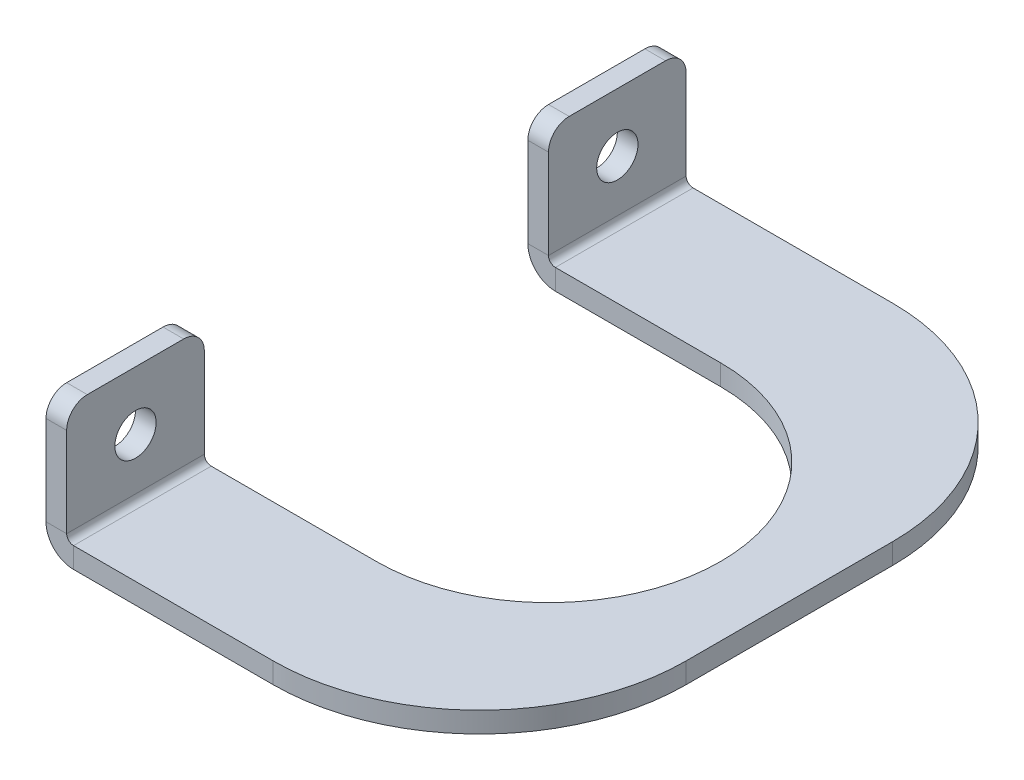
ISO-10303-21;
HEADER;
FILE_DESCRIPTION(('STEP AP214'),'2;1');
FILE_NAME('part.step','',(''),(''),'','','');
FILE_SCHEMA(('AUTOMOTIVE_DESIGN { 1 0 10303 214 1 1 1 1 }'));
ENDSEC;
DATA;
#1=APPLICATION_CONTEXT('core data for automotive mechanical design processes');
#2=APPLICATION_PROTOCOL_DEFINITION('international standard','automotive_design',2000,#1);
#3=PRODUCT_CONTEXT('',#1,'mechanical');
#4=PRODUCT('Part','Part','',(#3));
#5=PRODUCT_RELATED_PRODUCT_CATEGORY('part','',(#4));
#6=PRODUCT_DEFINITION_FORMATION('','',#4);
#7=PRODUCT_DEFINITION_CONTEXT('part definition',#1,'design');
#8=PRODUCT_DEFINITION('design','',#6,#7);
#9=PRODUCT_DEFINITION_SHAPE('','',#8);
#10=(LENGTH_UNIT() NAMED_UNIT(*) SI_UNIT(.MILLI.,.METRE.));
#11=(NAMED_UNIT(*) PLANE_ANGLE_UNIT() SI_UNIT($,.RADIAN.));
#12=(NAMED_UNIT(*) SI_UNIT($,.STERADIAN.) SOLID_ANGLE_UNIT());
#13=UNCERTAINTY_MEASURE_WITH_UNIT(LENGTH_MEASURE(1.E-05),#10,'distance_accuracy_value','');
#14=(GEOMETRIC_REPRESENTATION_CONTEXT(3) GLOBAL_UNCERTAINTY_ASSIGNED_CONTEXT((#13)) GLOBAL_UNIT_ASSIGNED_CONTEXT((#10,
#11,#12)) REPRESENTATION_CONTEXT('',''));
#15=CARTESIAN_POINT('',(0.,0.,0.));
#16=DIRECTION('',(0.,0.,1.));
#17=DIRECTION('',(1.,0.,0.));
#18=AXIS2_PLACEMENT_3D('',#15,#16,#17);
#19=CARTESIAN_POINT('',(0.,3.,0.));
#20=DIRECTION('',(0.,-1.,0.));
#21=DIRECTION('',(0.,0.,-1.));
#22=AXIS2_PLACEMENT_3D('',#19,#20,#21);
#23=PLANE('',#22);
#24=DIRECTION('',(0.,0.,1.));
#25=VECTOR('',#24,1.);
#26=CARTESIAN_POINT('',(-24.,3.,-25.));
#27=LINE('',#26,#25);
#28=CARTESIAN_POINT('',(-24.,3.,-25.));
#29=VERTEX_POINT('',#28);
#30=CARTESIAN_POINT('',(-24.,3.,-45.));
#31=VERTEX_POINT('',#30);
#32=EDGE_CURVE('E243',#29,#31,#27,.F.);
#33=ORIENTED_EDGE('',*,*,#32,.F.);
#34=DIRECTION('',(1.,0.,0.));
#35=VECTOR('',#34,1.);
#36=CARTESIAN_POINT('',(0.,3.,-25.));
#37=LINE('',#36,#35);
#38=CARTESIAN_POINT('',(0.,3.,-25.));
#39=VERTEX_POINT('',#38);
#40=EDGE_CURVE('E318',#29,#39,#37,.T.);
#41=ORIENTED_EDGE('',*,*,#40,.T.);
#42=CARTESIAN_POINT('',(0.,3.,0.));
#43=DIRECTION('',(0.,-1.,0.));
#44=DIRECTION('',(0.,0.,-1.));
#45=AXIS2_PLACEMENT_3D('',#42,#43,#44);
#46=CIRCLE('',#45,25.);
#47=CARTESIAN_POINT('',(0.,3.,25.));
#48=VERTEX_POINT('',#47);
#49=EDGE_CURVE('E297',#39,#48,#46,.T.);
#50=ORIENTED_EDGE('',*,*,#49,.T.);
#51=DIRECTION('',(-1.,0.,0.));
#52=VECTOR('',#51,1.);
#53=CARTESIAN_POINT('',(-25.,3.,25.));
#54=LINE('',#53,#52);
#55=CARTESIAN_POINT('',(-24.,3.,25.));
#56=VERTEX_POINT('',#55);
#57=EDGE_CURVE('E300',#48,#56,#54,.T.);
#58=ORIENTED_EDGE('',*,*,#57,.T.);
#59=DIRECTION('',(0.,0.,1.));
#60=VECTOR('',#59,1.);
#61=CARTESIAN_POINT('',(-24.,3.,45.));
#62=LINE('',#61,#60);
#63=CARTESIAN_POINT('',(-24.,3.,45.));
#64=VERTEX_POINT('',#63);
#65=EDGE_CURVE('E287',#64,#56,#62,.F.);
#66=ORIENTED_EDGE('',*,*,#65,.F.);
#67=DIRECTION('',(1.,0.,0.));
#68=VECTOR('',#67,1.);
#69=CARTESIAN_POINT('',(5.,3.,45.));
#70=LINE('',#69,#68);
#71=CARTESIAN_POINT('',(5.,3.,45.));
#72=VERTEX_POINT('',#71);
#73=EDGE_CURVE('E304',#64,#72,#70,.T.);
#74=ORIENTED_EDGE('',*,*,#73,.T.);
#75=CARTESIAN_POINT('',(5.,3.,15.));
#76=DIRECTION('',(0.,1.,0.));
#77=DIRECTION('',(0.,0.,-1.));
#78=AXIS2_PLACEMENT_3D('',#75,#76,#77);
#79=CIRCLE('',#78,30.);
#80=CARTESIAN_POINT('',(35.,3.,15.));
#81=VERTEX_POINT('',#80);
#82=EDGE_CURVE('E306',#72,#81,#79,.T.);
#83=ORIENTED_EDGE('',*,*,#82,.T.);
#84=DIRECTION('',(0.,0.,-1.));
#85=VECTOR('',#84,1.);
#86=CARTESIAN_POINT('',(35.,3.,-15.));
#87=LINE('',#86,#85);
#88=CARTESIAN_POINT('',(35.,3.,-15.));
#89=VERTEX_POINT('',#88);
#90=EDGE_CURVE('E309',#81,#89,#87,.T.);
#91=ORIENTED_EDGE('',*,*,#90,.T.);
#92=CARTESIAN_POINT('',(5.,3.,-15.));
#93=DIRECTION('',(0.,1.,0.));
#94=DIRECTION('',(0.,0.,-1.));
#95=AXIS2_PLACEMENT_3D('',#92,#93,#94);
#96=CIRCLE('',#95,30.);
#97=CARTESIAN_POINT('',(5.,3.,-45.));
#98=VERTEX_POINT('',#97);
#99=EDGE_CURVE('E312',#89,#98,#96,.T.);
#100=ORIENTED_EDGE('',*,*,#99,.T.);
#101=DIRECTION('',(-1.,0.,0.));
#102=VECTOR('',#101,1.);
#103=CARTESIAN_POINT('',(-25.,3.,-45.));
#104=LINE('',#103,#102);
#105=EDGE_CURVE('E315',#98,#31,#104,.T.);
#106=ORIENTED_EDGE('',*,*,#105,.T.);
#107=EDGE_LOOP('',(#33,#41,#50,#58,#66,#74,#83,#91,#100,#106));
#108=FACE_BOUND('',#107,.T.);
#109=ADVANCED_FACE('F38',(#108),#23,.F.);
#110=CARTESIAN_POINT('',(0.,0.,0.));
#111=DIRECTION('',(0.,-1.,0.));
#112=DIRECTION('',(0.,0.,-1.));
#113=AXIS2_PLACEMENT_3D('',#110,#111,#112);
#114=PLANE('',#113);
#115=DIRECTION('',(1.,0.,0.));
#116=VECTOR('',#115,1.);
#117=CARTESIAN_POINT('',(0.,0.,-25.));
#118=LINE('',#117,#116);
#119=CARTESIAN_POINT('',(-24.,0.,-25.));
#120=VERTEX_POINT('',#119);
#121=CARTESIAN_POINT('',(0.,0.,-25.));
#122=VERTEX_POINT('',#121);
#123=EDGE_CURVE('E301',#120,#122,#118,.T.);
#124=ORIENTED_EDGE('',*,*,#123,.F.);
#125=DIRECTION('',(0.,0.,1.));
#126=VECTOR('',#125,1.);
#127=CARTESIAN_POINT('',(-24.,0.,-25.));
#128=LINE('',#127,#126);
#129=CARTESIAN_POINT('',(-24.,0.,-45.));
#130=VERTEX_POINT('',#129);
#131=EDGE_CURVE('E196',#120,#130,#128,.F.);
#132=ORIENTED_EDGE('',*,*,#131,.T.);
#133=DIRECTION('',(1.,0.,0.));
#134=VECTOR('',#133,1.);
#135=CARTESIAN_POINT('',(0.,0.,-45.));
#136=LINE('',#135,#134);
#137=CARTESIAN_POINT('',(5.,0.,-45.));
#138=VERTEX_POINT('',#137);
#139=EDGE_CURVE('E325',#138,#130,#136,.F.);
#140=ORIENTED_EDGE('',*,*,#139,.F.);
#141=CARTESIAN_POINT('',(5.,0.,-15.));
#142=DIRECTION('',(0.,1.,0.));
#143=DIRECTION('',(0.,0.,1.));
#144=AXIS2_PLACEMENT_3D('',#141,#142,#143);
#145=CIRCLE('',#144,30.);
#146=CARTESIAN_POINT('',(35.,0.,-15.));
#147=VERTEX_POINT('',#146);
#148=EDGE_CURVE('E328',#147,#138,#145,.T.);
#149=ORIENTED_EDGE('',*,*,#148,.F.);
#150=DIRECTION('',(0.,0.,-1.));
#151=VECTOR('',#150,1.);
#152=CARTESIAN_POINT('',(35.,0.,0.));
#153=LINE('',#152,#151);
#154=CARTESIAN_POINT('',(35.,0.,15.));
#155=VERTEX_POINT('',#154);
#156=EDGE_CURVE('E331',#155,#147,#153,.T.);
#157=ORIENTED_EDGE('',*,*,#156,.F.);
#158=CARTESIAN_POINT('',(5.,0.,15.));
#159=DIRECTION('',(0.,1.,0.));
#160=DIRECTION('',(0.,0.,1.));
#161=AXIS2_PLACEMENT_3D('',#158,#159,#160);
#162=CIRCLE('',#161,30.);
#163=CARTESIAN_POINT('',(5.,0.,45.));
#164=VERTEX_POINT('',#163);
#165=EDGE_CURVE('E334',#164,#155,#162,.T.);
#166=ORIENTED_EDGE('',*,*,#165,.F.);
#167=DIRECTION('',(1.,0.,0.));
#168=VECTOR('',#167,1.);
#169=CARTESIAN_POINT('',(0.,0.,45.));
#170=LINE('',#169,#168);
#171=CARTESIAN_POINT('',(-24.,0.,45.));
#172=VERTEX_POINT('',#171);
#173=EDGE_CURVE('E337',#172,#164,#170,.T.);
#174=ORIENTED_EDGE('',*,*,#173,.F.);
#175=DIRECTION('',(0.,0.,1.));
#176=VECTOR('',#175,1.);
#177=CARTESIAN_POINT('',(-24.,0.,45.));
#178=LINE('',#177,#176);
#179=CARTESIAN_POINT('',(-24.,0.,25.));
#180=VERTEX_POINT('',#179);
#181=EDGE_CURVE('E274',#172,#180,#178,.F.);
#182=ORIENTED_EDGE('',*,*,#181,.T.);
#183=DIRECTION('',(1.,0.,0.));
#184=VECTOR('',#183,1.);
#185=CARTESIAN_POINT('',(0.,0.,25.));
#186=LINE('',#185,#184);
#187=CARTESIAN_POINT('',(0.,0.,25.));
#188=VERTEX_POINT('',#187);
#189=EDGE_CURVE('E323',#188,#180,#186,.F.);
#190=ORIENTED_EDGE('',*,*,#189,.F.);
#191=CARTESIAN_POINT('',(0.,0.,0.));
#192=DIRECTION('',(0.,-1.,0.));
#193=DIRECTION('',(0.,0.,-1.));
#194=AXIS2_PLACEMENT_3D('',#191,#192,#193);
#195=CIRCLE('',#194,25.);
#196=EDGE_CURVE('E294',#122,#188,#195,.T.);
#197=ORIENTED_EDGE('',*,*,#196,.F.);
#198=EDGE_LOOP('',(#124,#132,#140,#149,#157,#166,#174,#182,#190,#197));
#199=FACE_BOUND('',#198,.T.);
#200=ADVANCED_FACE('F421',(#199),#114,.T.);
#201=CARTESIAN_POINT('',(0.,3.,-25.));
#202=DIRECTION('',(0.,0.,-1.));
#203=DIRECTION('',(1.,0.,0.));
#204=AXIS2_PLACEMENT_3D('',#201,#202,#203);
#205=PLANE('',#204);
#206=ORIENTED_EDGE('',*,*,#40,.F.);
#207=DIRECTION('',(0.,-1.,0.));
#208=VECTOR('',#207,1.);
#209=CARTESIAN_POINT('',(-24.,3.,-25.));
#210=LINE('',#209,#208);
#211=EDGE_CURVE('E239',#29,#120,#210,.T.);
#212=ORIENTED_EDGE('',*,*,#211,.T.);
#213=ORIENTED_EDGE('',*,*,#123,.T.);
#214=DIRECTION('',(0.,1.,0.));
#215=VECTOR('',#214,1.);
#216=CARTESIAN_POINT('',(0.,3.,-25.));
#217=LINE('',#216,#215);
#218=EDGE_CURVE('E341',#122,#39,#217,.T.);
#219=ORIENTED_EDGE('',*,*,#218,.T.);
#220=EDGE_LOOP('',(#206,#212,#213,#219));
#221=FACE_BOUND('',#220,.T.);
#222=ADVANCED_FACE('F434',(#221),#205,.F.);
#223=CARTESIAN_POINT('',(5.,3.,45.));
#224=DIRECTION('',(0.,0.,-1.));
#225=DIRECTION('',(1.,0.,0.));
#226=AXIS2_PLACEMENT_3D('',#223,#224,#225);
#227=PLANE('',#226);
#228=ORIENTED_EDGE('',*,*,#73,.F.);
#229=DIRECTION('',(0.,-1.,0.));
#230=VECTOR('',#229,1.);
#231=CARTESIAN_POINT('',(-24.,3.,45.));
#232=LINE('',#231,#230);
#233=EDGE_CURVE('E281',#64,#172,#232,.T.);
#234=ORIENTED_EDGE('',*,*,#233,.T.);
#235=ORIENTED_EDGE('',*,*,#173,.T.);
#236=DIRECTION('',(0.,1.,0.));
#237=VECTOR('',#236,1.);
#238=CARTESIAN_POINT('',(5.,3.,45.));
#239=LINE('',#238,#237);
#240=EDGE_CURVE('E350',#164,#72,#239,.T.);
#241=ORIENTED_EDGE('',*,*,#240,.T.);
#242=EDGE_LOOP('',(#228,#234,#235,#241));
#243=FACE_BOUND('',#242,.T.);
#244=ADVANCED_FACE('F454',(#243),#227,.F.);
#245=CARTESIAN_POINT('',(5.,3.,15.));
#246=DIRECTION('',(0.,-1.,0.));
#247=DIRECTION('',(0.,0.,-1.));
#248=AXIS2_PLACEMENT_3D('',#245,#246,#247);
#249=CYLINDRICAL_SURFACE('',#248,30.);
#250=ORIENTED_EDGE('',*,*,#240,.F.);
#251=ORIENTED_EDGE('',*,*,#165,.T.);
#252=DIRECTION('',(0.,1.,0.));
#253=VECTOR('',#252,1.);
#254=CARTESIAN_POINT('',(35.,3.,15.));
#255=LINE('',#254,#253);
#256=EDGE_CURVE('E348',#155,#81,#255,.T.);
#257=ORIENTED_EDGE('',*,*,#256,.T.);
#258=ORIENTED_EDGE('',*,*,#82,.F.);
#259=EDGE_LOOP('',(#250,#251,#257,#258));
#260=FACE_BOUND('',#259,.T.);
#261=ADVANCED_FACE('F451',(#260),#249,.T.);
#262=CARTESIAN_POINT('',(35.,3.,-15.));
#263=DIRECTION('',(-1.,0.,0.));
#264=DIRECTION('',(0.,0.,-1.));
#265=AXIS2_PLACEMENT_3D('',#262,#263,#264);
#266=PLANE('',#265);
#267=ORIENTED_EDGE('',*,*,#256,.F.);
#268=ORIENTED_EDGE('',*,*,#156,.T.);
#269=DIRECTION('',(0.,1.,0.));
#270=VECTOR('',#269,1.);
#271=CARTESIAN_POINT('',(35.,3.,-15.));
#272=LINE('',#271,#270);
#273=EDGE_CURVE('E346',#147,#89,#272,.T.);
#274=ORIENTED_EDGE('',*,*,#273,.T.);
#275=ORIENTED_EDGE('',*,*,#90,.F.);
#276=EDGE_LOOP('',(#267,#268,#274,#275));
#277=FACE_BOUND('',#276,.T.);
#278=ADVANCED_FACE('F447',(#277),#266,.F.);
#279=CARTESIAN_POINT('',(5.,3.,-15.));
#280=DIRECTION('',(0.,-1.,0.));
#281=DIRECTION('',(0.,0.,-1.));
#282=AXIS2_PLACEMENT_3D('',#279,#280,#281);
#283=CYLINDRICAL_SURFACE('',#282,30.);
#284=ORIENTED_EDGE('',*,*,#273,.F.);
#285=ORIENTED_EDGE('',*,*,#148,.T.);
#286=DIRECTION('',(0.,1.,0.));
#287=VECTOR('',#286,1.);
#288=CARTESIAN_POINT('',(5.,3.,-45.));
#289=LINE('',#288,#287);
#290=EDGE_CURVE('E344',#138,#98,#289,.T.);
#291=ORIENTED_EDGE('',*,*,#290,.T.);
#292=ORIENTED_EDGE('',*,*,#99,.F.);
#293=EDGE_LOOP('',(#284,#285,#291,#292));
#294=FACE_BOUND('',#293,.T.);
#295=ADVANCED_FACE('F443',(#294),#283,.T.);
#296=CARTESIAN_POINT('',(-25.,3.,-45.));
#297=DIRECTION('',(0.,0.,1.));
#298=DIRECTION('',(-1.,0.,0.));
#299=AXIS2_PLACEMENT_3D('',#296,#297,#298);
#300=PLANE('',#299);
#301=DIRECTION('',(0.,-1.,0.));
#302=VECTOR('',#301,1.);
#303=CARTESIAN_POINT('',(-24.,3.,-45.));
#304=LINE('',#303,#302);
#305=EDGE_CURVE('E246',#31,#130,#304,.T.);
#306=ORIENTED_EDGE('',*,*,#305,.F.);
#307=ORIENTED_EDGE('',*,*,#105,.F.);
#308=ORIENTED_EDGE('',*,*,#290,.F.);
#309=ORIENTED_EDGE('',*,*,#139,.T.);
#310=EDGE_LOOP('',(#306,#307,#308,#309));
#311=FACE_BOUND('',#310,.T.);
#312=ADVANCED_FACE('F439',(#311),#300,.F.);
#313=CARTESIAN_POINT('',(0.,3.,0.));
#314=DIRECTION('',(0.,-1.,0.));
#315=DIRECTION('',(0.,0.,-1.));
#316=AXIS2_PLACEMENT_3D('',#313,#314,#315);
#317=CYLINDRICAL_SURFACE('',#316,25.);
#318=ORIENTED_EDGE('',*,*,#218,.F.);
#319=ORIENTED_EDGE('',*,*,#196,.T.);
#320=DIRECTION('',(0.,1.,0.));
#321=VECTOR('',#320,1.);
#322=CARTESIAN_POINT('',(0.,3.,25.));
#323=LINE('',#322,#321);
#324=EDGE_CURVE('E320',#188,#48,#323,.T.);
#325=ORIENTED_EDGE('',*,*,#324,.T.);
#326=ORIENTED_EDGE('',*,*,#49,.F.);
#327=EDGE_LOOP('',(#318,#319,#325,#326));
#328=FACE_BOUND('',#327,.T.);
#329=ADVANCED_FACE('F428',(#328),#317,.F.);
#330=CARTESIAN_POINT('',(-25.,3.,25.));
#331=DIRECTION('',(0.,0.,1.));
#332=DIRECTION('',(-1.,0.,0.));
#333=AXIS2_PLACEMENT_3D('',#330,#331,#332);
#334=PLANE('',#333);
#335=DIRECTION('',(0.,-1.,0.));
#336=VECTOR('',#335,1.);
#337=CARTESIAN_POINT('',(-24.,3.,25.));
#338=LINE('',#337,#336);
#339=EDGE_CURVE('E291',#56,#180,#338,.T.);
#340=ORIENTED_EDGE('',*,*,#339,.F.);
#341=ORIENTED_EDGE('',*,*,#57,.F.);
#342=ORIENTED_EDGE('',*,*,#324,.F.);
#343=ORIENTED_EDGE('',*,*,#189,.T.);
#344=EDGE_LOOP('',(#340,#341,#342,#343));
#345=FACE_BOUND('',#344,.T.);
#346=ADVANCED_FACE('F424',(#345),#334,.F.);
#347=CARTESIAN_POINT('',(-24.,4.,25.));
#348=DIRECTION('',(0.,0.,-1.));
#349=DIRECTION('',(-1.,0.,0.));
#350=AXIS2_PLACEMENT_3D('',#347,#348,#349);
#351=PLANE('',#350);
#352=DIRECTION('',(-1.,0.,0.));
#353=VECTOR('',#352,1.);
#354=CARTESIAN_POINT('',(-25.,4.,25.));
#355=LINE('',#354,#353);
#356=CARTESIAN_POINT('',(-25.,4.,25.));
#357=VERTEX_POINT('',#356);
#358=CARTESIAN_POINT('',(-28.,3.99999999999999,25.));
#359=VERTEX_POINT('',#358);
#360=EDGE_CURVE('E249',#357,#359,#355,.T.);
#361=ORIENTED_EDGE('',*,*,#360,.F.);
#362=CARTESIAN_POINT('',(-24.,4.,25.));
#363=DIRECTION('',(0.,0.,1.));
#364=DIRECTION('',(1.,0.,0.));
#365=AXIS2_PLACEMENT_3D('',#362,#363,#364);
#366=CIRCLE('',#365,1.);
#367=EDGE_CURVE('E284',#56,#357,#366,.F.);
#368=ORIENTED_EDGE('',*,*,#367,.F.);
#369=ORIENTED_EDGE('',*,*,#339,.T.);
#370=CARTESIAN_POINT('',(-24.,4.,25.));
#371=DIRECTION('',(0.,0.,1.));
#372=DIRECTION('',(1.,0.,0.));
#373=AXIS2_PLACEMENT_3D('',#370,#371,#372);
#374=CIRCLE('',#373,4.);
#375=EDGE_CURVE('E277',#180,#359,#374,.F.);
#376=ORIENTED_EDGE('',*,*,#375,.T.);
#377=EDGE_LOOP('',(#361,#368,#369,#376));
#378=FACE_BOUND('',#377,.T.);
#379=ADVANCED_FACE('F412',(#378),#351,.T.);
#380=CARTESIAN_POINT('',(-24.,4.,45.));
#381=DIRECTION('',(0.,0.,-1.));
#382=DIRECTION('',(-1.,0.,0.));
#383=AXIS2_PLACEMENT_3D('',#380,#381,#382);
#384=PLANE('',#383);
#385=CARTESIAN_POINT('',(-24.,4.,45.));
#386=DIRECTION('',(0.,0.,1.));
#387=DIRECTION('',(1.,0.,0.));
#388=AXIS2_PLACEMENT_3D('',#385,#386,#387);
#389=CIRCLE('',#388,1.);
#390=CARTESIAN_POINT('',(-25.,4.,45.));
#391=VERTEX_POINT('',#390);
#392=EDGE_CURVE('E269',#391,#64,#389,.T.);
#393=ORIENTED_EDGE('',*,*,#392,.F.);
#394=DIRECTION('',(-1.,0.,0.));
#395=VECTOR('',#394,1.);
#396=CARTESIAN_POINT('',(-25.,4.,45.));
#397=LINE('',#396,#395);
#398=CARTESIAN_POINT('',(-28.,3.99999999999999,45.));
#399=VERTEX_POINT('',#398);
#400=EDGE_CURVE('E253',#391,#399,#397,.T.);
#401=ORIENTED_EDGE('',*,*,#400,.T.);
#402=CARTESIAN_POINT('',(-24.,4.,45.));
#403=DIRECTION('',(0.,0.,1.));
#404=DIRECTION('',(1.,0.,0.));
#405=AXIS2_PLACEMENT_3D('',#402,#403,#404);
#406=CIRCLE('',#405,4.);
#407=EDGE_CURVE('E278',#399,#172,#406,.T.);
#408=ORIENTED_EDGE('',*,*,#407,.T.);
#409=ORIENTED_EDGE('',*,*,#233,.F.);
#410=EDGE_LOOP('',(#393,#401,#408,#409));
#411=FACE_BOUND('',#410,.T.);
#412=ADVANCED_FACE('F408',(#411),#384,.F.);
#413=CARTESIAN_POINT('',(-24.,4.,45.));
#414=DIRECTION('',(0.,0.,1.));
#415=DIRECTION('',(-1.,0.,0.));
#416=AXIS2_PLACEMENT_3D('',#413,#414,#415);
#417=CYLINDRICAL_SURFACE('',#416,4.);
#418=ORIENTED_EDGE('',*,*,#181,.F.);
#419=ORIENTED_EDGE('',*,*,#407,.F.);
#420=DIRECTION('',(0.,0.,-1.));
#421=VECTOR('',#420,1.);
#422=CARTESIAN_POINT('',(-28.,3.99999999999999,0.));
#423=LINE('',#422,#421);
#424=EDGE_CURVE('E256',#399,#359,#423,.T.);
#425=ORIENTED_EDGE('',*,*,#424,.T.);
#426=ORIENTED_EDGE('',*,*,#375,.F.);
#427=EDGE_LOOP('',(#418,#419,#425,#426));
#428=FACE_BOUND('',#427,.T.);
#429=ADVANCED_FACE('F410',(#428),#417,.T.);
#430=CARTESIAN_POINT('',(-24.,4.,45.));
#431=DIRECTION('',(0.,0.,1.));
#432=DIRECTION('',(-1.,0.,0.));
#433=AXIS2_PLACEMENT_3D('',#430,#431,#432);
#434=CYLINDRICAL_SURFACE('',#433,1.);
#435=ORIENTED_EDGE('',*,*,#65,.T.);
#436=ORIENTED_EDGE('',*,*,#367,.T.);
#437=DIRECTION('',(0.,0.,1.));
#438=VECTOR('',#437,1.);
#439=CARTESIAN_POINT('',(-25.,4.,25.));
#440=LINE('',#439,#438);
#441=EDGE_CURVE('E251',#357,#391,#440,.T.);
#442=ORIENTED_EDGE('',*,*,#441,.T.);
#443=ORIENTED_EDGE('',*,*,#392,.T.);
#444=EDGE_LOOP('',(#435,#436,#442,#443));
#445=FACE_BOUND('',#444,.T.);
#446=ADVANCED_FACE('F456',(#445),#434,.F.);
#447=CARTESIAN_POINT('',(-28.,2.99999999999999,25.));
#448=DIRECTION('',(0.,0.,1.));
#449=DIRECTION('',(1.,0.,0.));
#450=AXIS2_PLACEMENT_3D('',#447,#448,#449);
#451=PLANE('',#450);
#452=DIRECTION('',(0.,-1.,0.));
#453=VECTOR('',#452,1.);
#454=CARTESIAN_POINT('',(-28.,2.99999999999999,25.));
#455=LINE('',#454,#453);
#456=CARTESIAN_POINT('',(-28.,17.,25.));
#457=VERTEX_POINT('',#456);
#458=EDGE_CURVE('E262',#457,#359,#455,.T.);
#459=ORIENTED_EDGE('',*,*,#458,.F.);
#460=DIRECTION('',(1.,0.,0.));
#461=VECTOR('',#460,1.);
#462=CARTESIAN_POINT('',(-28.,17.,25.));
#463=LINE('',#462,#461);
#464=CARTESIAN_POINT('',(-25.,17.,25.));
#465=VERTEX_POINT('',#464);
#466=EDGE_CURVE('E371',#457,#465,#463,.T.);
#467=ORIENTED_EDGE('',*,*,#466,.T.);
#468=DIRECTION('',(0.,-1.,0.));
#469=VECTOR('',#468,1.);
#470=CARTESIAN_POINT('',(-25.,3.,25.));
#471=LINE('',#470,#469);
#472=EDGE_CURVE('E261',#465,#357,#471,.T.);
#473=ORIENTED_EDGE('',*,*,#472,.T.);
#474=ORIENTED_EDGE('',*,*,#360,.T.);
#475=EDGE_LOOP('',(#459,#467,#473,#474));
#476=FACE_BOUND('',#475,.T.);
#477=ADVANCED_FACE('F391',(#476),#451,.F.);
#478=CARTESIAN_POINT('',(-28.0000000000001,20.,45.));
#479=DIRECTION('',(0.,0.,-1.));
#480=DIRECTION('',(-1.,0.,0.));
#481=AXIS2_PLACEMENT_3D('',#478,#479,#480);
#482=PLANE('',#481);
#483=DIRECTION('',(0.,1.,0.));
#484=VECTOR('',#483,1.);
#485=CARTESIAN_POINT('',(-25.0000000000001,20.,45.));
#486=LINE('',#485,#484);
#487=CARTESIAN_POINT('',(-25.,17.,45.));
#488=VERTEX_POINT('',#487);
#489=EDGE_CURVE('E271',#391,#488,#486,.T.);
#490=ORIENTED_EDGE('',*,*,#489,.T.);
#491=DIRECTION('',(1.,0.,0.));
#492=VECTOR('',#491,1.);
#493=CARTESIAN_POINT('',(-28.,17.,45.));
#494=LINE('',#493,#492);
#495=CARTESIAN_POINT('',(-28.,17.,45.));
#496=VERTEX_POINT('',#495);
#497=EDGE_CURVE('E11',#488,#496,#494,.F.);
#498=ORIENTED_EDGE('',*,*,#497,.T.);
#499=DIRECTION('',(0.,1.,0.));
#500=VECTOR('',#499,1.);
#501=CARTESIAN_POINT('',(-28.0000000000001,20.,45.));
#502=LINE('',#501,#500);
#503=EDGE_CURVE('E264',#399,#496,#502,.T.);
#504=ORIENTED_EDGE('',*,*,#503,.F.);
#505=ORIENTED_EDGE('',*,*,#400,.F.);
#506=EDGE_LOOP('',(#490,#498,#504,#505));
#507=FACE_BOUND('',#506,.T.);
#508=ADVANCED_FACE('F405',(#507),#482,.F.);
#509=CARTESIAN_POINT('',(-28.,0.,0.));
#510=DIRECTION('',(1.,0.,0.));
#511=DIRECTION('',(0.,1.,0.));
#512=AXIS2_PLACEMENT_3D('',#509,#510,#511);
#513=PLANE('',#512);
#514=CARTESIAN_POINT('',(-28.,11.5,35.));
#515=DIRECTION('',(1.,0.,0.));
#516=DIRECTION('',(0.,1.,0.));
#517=AXIS2_PLACEMENT_3D('',#514,#515,#516);
#518=CIRCLE('',#517,3.);
#519=CARTESIAN_POINT('',(-28.,14.5,35.));
#520=VERTEX_POINT('',#519);
#521=EDGE_CURVE('E837',#520,#520,#518,.F.);
#522=ORIENTED_EDGE('',*,*,#521,.F.);
#523=EDGE_LOOP('',(#522));
#524=FACE_BOUND('',#523,.T.);
#525=DIRECTION('',(0.,0.,-1.));
#526=VECTOR('',#525,1.);
#527=CARTESIAN_POINT('',(-28.0000000000001,20.,25.));
#528=LINE('',#527,#526);
#529=CARTESIAN_POINT('',(-28.0000000000001,20.,42.));
#530=VERTEX_POINT('',#529);
#531=CARTESIAN_POINT('',(-28.0000000000001,20.,28.));
#532=VERTEX_POINT('',#531);
#533=EDGE_CURVE('E267',#530,#532,#528,.T.);
#534=ORIENTED_EDGE('',*,*,#533,.T.);
#535=CARTESIAN_POINT('',(-28.,17.,28.));
#536=DIRECTION('',(1.,0.,0.));
#537=DIRECTION('',(0.,1.,0.));
#538=AXIS2_PLACEMENT_3D('',#535,#536,#537);
#539=CIRCLE('',#538,3.);
#540=EDGE_CURVE('E46',#532,#457,#539,.F.);
#541=ORIENTED_EDGE('',*,*,#540,.T.);
#542=ORIENTED_EDGE('',*,*,#458,.T.);
#543=ORIENTED_EDGE('',*,*,#424,.F.);
#544=ORIENTED_EDGE('',*,*,#503,.T.);
#545=CARTESIAN_POINT('',(-28.,17.,42.));
#546=DIRECTION('',(1.,0.,0.));
#547=DIRECTION('',(0.,1.,0.));
#548=AXIS2_PLACEMENT_3D('',#545,#546,#547);
#549=CIRCLE('',#548,3.);
#550=EDGE_CURVE('E382',#496,#530,#549,.F.);
#551=ORIENTED_EDGE('',*,*,#550,.T.);
#552=EDGE_LOOP('',(#534,#541,#542,#543,#544,#551));
#553=FACE_BOUND('',#552,.T.);
#554=ADVANCED_FACE('F386',(#524,#553),#513,.F.);
#555=CARTESIAN_POINT('',(-25.,0.,0.));
#556=DIRECTION('',(1.,0.,0.));
#557=DIRECTION('',(0.,1.,0.));
#558=AXIS2_PLACEMENT_3D('',#555,#556,#557);
#559=PLANE('',#558);
#560=CARTESIAN_POINT('',(-25.,11.5,35.));
#561=DIRECTION('',(1.,0.,0.));
#562=DIRECTION('',(0.,-1.,0.));
#563=AXIS2_PLACEMENT_3D('',#560,#561,#562);
#564=CIRCLE('',#563,3.);
#565=CARTESIAN_POINT('',(-25.,8.5,35.));
#566=VERTEX_POINT('',#565);
#567=EDGE_CURVE('E836',#566,#566,#564,.T.);
#568=ORIENTED_EDGE('',*,*,#567,.F.);
#569=EDGE_LOOP('',(#568));
#570=FACE_BOUND('',#569,.T.);
#571=ORIENTED_EDGE('',*,*,#472,.F.);
#572=CARTESIAN_POINT('',(-25.,17.,28.));
#573=DIRECTION('',(1.,0.,0.));
#574=DIRECTION('',(0.,1.,0.));
#575=AXIS2_PLACEMENT_3D('',#572,#573,#574);
#576=CIRCLE('',#575,3.);
#577=CARTESIAN_POINT('',(-25.0000000000001,20.,28.));
#578=VERTEX_POINT('',#577);
#579=EDGE_CURVE('E376',#465,#578,#576,.T.);
#580=ORIENTED_EDGE('',*,*,#579,.T.);
#581=DIRECTION('',(0.,0.,-1.));
#582=VECTOR('',#581,1.);
#583=CARTESIAN_POINT('',(-25.0000000000001,20.,25.));
#584=LINE('',#583,#582);
#585=CARTESIAN_POINT('',(-25.0000000000001,20.,42.));
#586=VERTEX_POINT('',#585);
#587=EDGE_CURVE('E265',#586,#578,#584,.T.);
#588=ORIENTED_EDGE('',*,*,#587,.F.);
#589=CARTESIAN_POINT('',(-25.,17.,42.));
#590=DIRECTION('',(1.,0.,0.));
#591=DIRECTION('',(0.,1.,0.));
#592=AXIS2_PLACEMENT_3D('',#589,#590,#591);
#593=CIRCLE('',#592,3.);
#594=EDGE_CURVE('E374',#586,#488,#593,.T.);
#595=ORIENTED_EDGE('',*,*,#594,.T.);
#596=ORIENTED_EDGE('',*,*,#489,.F.);
#597=ORIENTED_EDGE('',*,*,#441,.F.);
#598=EDGE_LOOP('',(#571,#580,#588,#595,#596,#597));
#599=FACE_BOUND('',#598,.T.);
#600=ADVANCED_FACE('F397',(#570,#599),#559,.T.);
#601=CARTESIAN_POINT('',(-28.0000000000001,20.,25.));
#602=DIRECTION('',(0.,-1.,0.));
#603=DIRECTION('',(1.,0.,0.));
#604=AXIS2_PLACEMENT_3D('',#601,#602,#603);
#605=PLANE('',#604);
#606=ORIENTED_EDGE('',*,*,#587,.T.);
#607=DIRECTION('',(1.,0.,0.));
#608=VECTOR('',#607,1.);
#609=CARTESIAN_POINT('',(-28.0000000000001,20.,28.));
#610=LINE('',#609,#608);
#611=EDGE_CURVE('E59',#578,#532,#610,.F.);
#612=ORIENTED_EDGE('',*,*,#611,.T.);
#613=ORIENTED_EDGE('',*,*,#533,.F.);
#614=DIRECTION('',(1.,0.,0.));
#615=VECTOR('',#614,1.);
#616=CARTESIAN_POINT('',(-28.0000000000001,20.,42.));
#617=LINE('',#616,#615);
#618=EDGE_CURVE('E378',#530,#586,#617,.T.);
#619=ORIENTED_EDGE('',*,*,#618,.T.);
#620=EDGE_LOOP('',(#606,#612,#613,#619));
#621=FACE_BOUND('',#620,.T.);
#622=ADVANCED_FACE('F399',(#621),#605,.F.);
#623=CARTESIAN_POINT('',(-24.,4.,-45.));
#624=DIRECTION('',(0.,0.,-1.));
#625=DIRECTION('',(-1.,0.,0.));
#626=AXIS2_PLACEMENT_3D('',#623,#624,#625);
#627=PLANE('',#626);
#628=DIRECTION('',(-1.,0.,0.));
#629=VECTOR('',#628,1.);
#630=CARTESIAN_POINT('',(-25.,4.,-45.));
#631=LINE('',#630,#629);
#632=CARTESIAN_POINT('',(-25.,4.,-45.));
#633=VERTEX_POINT('',#632);
#634=CARTESIAN_POINT('',(-28.,3.99999999999999,-45.));
#635=VERTEX_POINT('',#634);
#636=EDGE_CURVE('E846',#633,#635,#631,.T.);
#637=ORIENTED_EDGE('',*,*,#636,.F.);
#638=CARTESIAN_POINT('',(-24.,4.,-45.));
#639=DIRECTION('',(0.,0.,1.));
#640=DIRECTION('',(1.,0.,0.));
#641=AXIS2_PLACEMENT_3D('',#638,#639,#640);
#642=CIRCLE('',#641,1.);
#643=EDGE_CURVE('E199',#31,#633,#642,.F.);
#644=ORIENTED_EDGE('',*,*,#643,.F.);
#645=ORIENTED_EDGE('',*,*,#305,.T.);
#646=CARTESIAN_POINT('',(-24.,4.,-45.));
#647=DIRECTION('',(0.,0.,1.));
#648=DIRECTION('',(1.,0.,0.));
#649=AXIS2_PLACEMENT_3D('',#646,#647,#648);
#650=CIRCLE('',#649,4.);
#651=EDGE_CURVE('E238',#130,#635,#650,.F.);
#652=ORIENTED_EDGE('',*,*,#651,.T.);
#653=EDGE_LOOP('',(#637,#644,#645,#652));
#654=FACE_BOUND('',#653,.T.);
#655=ADVANCED_FACE('F539',(#654),#627,.T.);
#656=CARTESIAN_POINT('',(-24.,4.,-25.));
#657=DIRECTION('',(0.,0.,-1.));
#658=DIRECTION('',(-1.,0.,0.));
#659=AXIS2_PLACEMENT_3D('',#656,#657,#658);
#660=PLANE('',#659);
#661=CARTESIAN_POINT('',(-24.,4.,-25.));
#662=DIRECTION('',(0.,0.,1.));
#663=DIRECTION('',(1.,0.,0.));
#664=AXIS2_PLACEMENT_3D('',#661,#662,#663);
#665=CIRCLE('',#664,1.);
#666=CARTESIAN_POINT('',(-25.,4.,-25.));
#667=VERTEX_POINT('',#666);
#668=EDGE_CURVE('E206',#667,#29,#665,.T.);
#669=ORIENTED_EDGE('',*,*,#668,.F.);
#670=DIRECTION('',(-1.,0.,0.));
#671=VECTOR('',#670,1.);
#672=CARTESIAN_POINT('',(-25.,4.,-25.));
#673=LINE('',#672,#671);
#674=CARTESIAN_POINT('',(-28.,3.99999999999999,-25.));
#675=VERTEX_POINT('',#674);
#676=EDGE_CURVE('E203',#667,#675,#673,.T.);
#677=ORIENTED_EDGE('',*,*,#676,.T.);
#678=CARTESIAN_POINT('',(-24.,4.,-25.));
#679=DIRECTION('',(0.,0.,1.));
#680=DIRECTION('',(1.,0.,0.));
#681=AXIS2_PLACEMENT_3D('',#678,#679,#680);
#682=CIRCLE('',#681,4.);
#683=EDGE_CURVE('E189',#675,#120,#682,.T.);
#684=ORIENTED_EDGE('',*,*,#683,.T.);
#685=ORIENTED_EDGE('',*,*,#211,.F.);
#686=EDGE_LOOP('',(#669,#677,#684,#685));
#687=FACE_BOUND('',#686,.T.);
#688=ADVANCED_FACE('F204',(#687),#660,.F.);
#689=CARTESIAN_POINT('',(-24.,4.,-25.));
#690=DIRECTION('',(0.,0.,1.));
#691=DIRECTION('',(-1.,0.,0.));
#692=AXIS2_PLACEMENT_3D('',#689,#690,#691);
#693=CYLINDRICAL_SURFACE('',#692,4.);
#694=ORIENTED_EDGE('',*,*,#131,.F.);
#695=ORIENTED_EDGE('',*,*,#683,.F.);
#696=DIRECTION('',(0.,0.,-1.));
#697=VECTOR('',#696,1.);
#698=CARTESIAN_POINT('',(-28.,3.99999999999999,0.));
#699=LINE('',#698,#697);
#700=EDGE_CURVE('E193',#675,#635,#699,.T.);
#701=ORIENTED_EDGE('',*,*,#700,.T.);
#702=ORIENTED_EDGE('',*,*,#651,.F.);
#703=EDGE_LOOP('',(#694,#695,#701,#702));
#704=FACE_BOUND('',#703,.T.);
#705=ADVANCED_FACE('F191',(#704),#693,.T.);
#706=CARTESIAN_POINT('',(-24.,4.,-25.));
#707=DIRECTION('',(0.,0.,1.));
#708=DIRECTION('',(-1.,0.,0.));
#709=AXIS2_PLACEMENT_3D('',#706,#707,#708);
#710=CYLINDRICAL_SURFACE('',#709,1.);
#711=ORIENTED_EDGE('',*,*,#32,.T.);
#712=ORIENTED_EDGE('',*,*,#643,.T.);
#713=DIRECTION('',(0.,0.,1.));
#714=VECTOR('',#713,1.);
#715=CARTESIAN_POINT('',(-25.,4.,-45.));
#716=LINE('',#715,#714);
#717=EDGE_CURVE('E211',#633,#667,#716,.T.);
#718=ORIENTED_EDGE('',*,*,#717,.T.);
#719=ORIENTED_EDGE('',*,*,#668,.T.);
#720=EDGE_LOOP('',(#711,#712,#718,#719));
#721=FACE_BOUND('',#720,.T.);
#722=ADVANCED_FACE('F532',(#721),#710,.F.);
#723=CARTESIAN_POINT('',(-28.,2.99999999999999,-45.));
#724=DIRECTION('',(0.,0.,1.));
#725=DIRECTION('',(1.,0.,0.));
#726=AXIS2_PLACEMENT_3D('',#723,#724,#725);
#727=PLANE('',#726);
#728=DIRECTION('',(0.,-1.,0.));
#729=VECTOR('',#728,1.);
#730=CARTESIAN_POINT('',(-28.,2.99999999999999,-45.));
#731=LINE('',#730,#729);
#732=CARTESIAN_POINT('',(-28.,17.,-45.));
#733=VERTEX_POINT('',#732);
#734=EDGE_CURVE('E220',#733,#635,#731,.T.);
#735=ORIENTED_EDGE('',*,*,#734,.F.);
#736=DIRECTION('',(1.,0.,0.));
#737=VECTOR('',#736,1.);
#738=CARTESIAN_POINT('',(-28.,17.,-45.));
#739=LINE('',#738,#737);
#740=CARTESIAN_POINT('',(-25.,17.,-45.));
#741=VERTEX_POINT('',#740);
#742=EDGE_CURVE('E353',#733,#741,#739,.T.);
#743=ORIENTED_EDGE('',*,*,#742,.T.);
#744=DIRECTION('',(0.,-1.,0.));
#745=VECTOR('',#744,1.);
#746=CARTESIAN_POINT('',(-25.,3.,-45.));
#747=LINE('',#746,#745);
#748=EDGE_CURVE('E221',#741,#633,#747,.T.);
#749=ORIENTED_EDGE('',*,*,#748,.T.);
#750=ORIENTED_EDGE('',*,*,#636,.T.);
#751=EDGE_LOOP('',(#735,#743,#749,#750));
#752=FACE_BOUND('',#751,.T.);
#753=ADVANCED_FACE('F529',(#752),#727,.F.);
#754=CARTESIAN_POINT('',(-28.0000000000001,20.,-25.));
#755=DIRECTION('',(0.,0.,-1.));
#756=DIRECTION('',(0.,1.,0.));
#757=AXIS2_PLACEMENT_3D('',#754,#755,#756);
#758=PLANE('',#757);
#759=DIRECTION('',(0.,1.,0.));
#760=VECTOR('',#759,1.);
#761=CARTESIAN_POINT('',(-25.0000000000001,20.,-25.));
#762=LINE('',#761,#760);
#763=CARTESIAN_POINT('',(-25.,17.,-25.));
#764=VERTEX_POINT('',#763);
#765=EDGE_CURVE('E233',#667,#764,#762,.T.);
#766=ORIENTED_EDGE('',*,*,#765,.T.);
#767=DIRECTION('',(1.,0.,0.));
#768=VECTOR('',#767,1.);
#769=CARTESIAN_POINT('',(-28.,17.,-25.));
#770=LINE('',#769,#768);
#771=CARTESIAN_POINT('',(-28.,17.,-25.));
#772=VERTEX_POINT('',#771);
#773=EDGE_CURVE('E225',#764,#772,#770,.F.);
#774=ORIENTED_EDGE('',*,*,#773,.T.);
#775=DIRECTION('',(0.,1.,0.));
#776=VECTOR('',#775,1.);
#777=CARTESIAN_POINT('',(-28.0000000000001,20.,-25.));
#778=LINE('',#777,#776);
#779=EDGE_CURVE('E217',#675,#772,#778,.T.);
#780=ORIENTED_EDGE('',*,*,#779,.F.);
#781=ORIENTED_EDGE('',*,*,#676,.F.);
#782=EDGE_LOOP('',(#766,#774,#780,#781));
#783=FACE_BOUND('',#782,.T.);
#784=ADVANCED_FACE('F223',(#783),#758,.F.);
#785=CARTESIAN_POINT('',(-28.,0.,0.));
#786=DIRECTION('',(1.,0.,0.));
#787=DIRECTION('',(0.,1.,0.));
#788=AXIS2_PLACEMENT_3D('',#785,#786,#787);
#789=PLANE('',#788);
#790=CARTESIAN_POINT('',(-28.,11.5,-35.));
#791=DIRECTION('',(1.,0.,0.));
#792=DIRECTION('',(0.,1.,0.));
#793=AXIS2_PLACEMENT_3D('',#790,#791,#792);
#794=CIRCLE('',#793,3.);
#795=CARTESIAN_POINT('',(-28.,14.5,-35.));
#796=VERTEX_POINT('',#795);
#797=EDGE_CURVE('E843',#796,#796,#794,.F.);
#798=ORIENTED_EDGE('',*,*,#797,.F.);
#799=EDGE_LOOP('',(#798));
#800=FACE_BOUND('',#799,.T.);
#801=DIRECTION('',(0.,0.,-1.));
#802=VECTOR('',#801,1.);
#803=CARTESIAN_POINT('',(-28.0000000000001,20.,-45.));
#804=LINE('',#803,#802);
#805=CARTESIAN_POINT('',(-28.0000000000001,20.,-28.));
#806=VERTEX_POINT('',#805);
#807=CARTESIAN_POINT('',(-28.0000000000001,20.,-42.));
#808=VERTEX_POINT('',#807);
#809=EDGE_CURVE('E226',#806,#808,#804,.T.);
#810=ORIENTED_EDGE('',*,*,#809,.T.);
#811=CARTESIAN_POINT('',(-28.,17.,-42.));
#812=DIRECTION('',(1.,0.,0.));
#813=DIRECTION('',(0.,1.,0.));
#814=AXIS2_PLACEMENT_3D('',#811,#812,#813);
#815=CIRCLE('',#814,3.);
#816=EDGE_CURVE('E368',#808,#733,#815,.F.);
#817=ORIENTED_EDGE('',*,*,#816,.T.);
#818=ORIENTED_EDGE('',*,*,#734,.T.);
#819=ORIENTED_EDGE('',*,*,#700,.F.);
#820=ORIENTED_EDGE('',*,*,#779,.T.);
#821=CARTESIAN_POINT('',(-28.,17.,-28.));
#822=DIRECTION('',(1.,0.,0.));
#823=DIRECTION('',(0.,1.,0.));
#824=AXIS2_PLACEMENT_3D('',#821,#822,#823);
#825=CIRCLE('',#824,3.);
#826=EDGE_CURVE('E366',#772,#806,#825,.F.);
#827=ORIENTED_EDGE('',*,*,#826,.T.);
#828=EDGE_LOOP('',(#810,#817,#818,#819,#820,#827));
#829=FACE_BOUND('',#828,.T.);
#830=ADVANCED_FACE('F216',(#800,#829),#789,.F.);
#831=CARTESIAN_POINT('',(-25.,0.,0.));
#832=DIRECTION('',(1.,0.,0.));
#833=DIRECTION('',(0.,1.,0.));
#834=AXIS2_PLACEMENT_3D('',#831,#832,#833);
#835=PLANE('',#834);
#836=CARTESIAN_POINT('',(-25.,11.5,-35.));
#837=DIRECTION('',(1.,0.,0.));
#838=DIRECTION('',(0.,1.,0.));
#839=AXIS2_PLACEMENT_3D('',#836,#837,#838);
#840=CIRCLE('',#839,3.);
#841=CARTESIAN_POINT('',(-25.,14.5,-35.));
#842=VERTEX_POINT('',#841);
#843=EDGE_CURVE('E840',#842,#842,#840,.T.);
#844=ORIENTED_EDGE('',*,*,#843,.F.);
#845=EDGE_LOOP('',(#844));
#846=FACE_BOUND('',#845,.T.);
#847=ORIENTED_EDGE('',*,*,#748,.F.);
#848=CARTESIAN_POINT('',(-25.,17.,-42.));
#849=DIRECTION('',(1.,0.,0.));
#850=DIRECTION('',(0.,1.,0.));
#851=AXIS2_PLACEMENT_3D('',#848,#849,#850);
#852=CIRCLE('',#851,3.);
#853=CARTESIAN_POINT('',(-25.0000000000001,20.,-42.));
#854=VERTEX_POINT('',#853);
#855=EDGE_CURVE('E359',#741,#854,#852,.T.);
#856=ORIENTED_EDGE('',*,*,#855,.T.);
#857=DIRECTION('',(0.,0.,-1.));
#858=VECTOR('',#857,1.);
#859=CARTESIAN_POINT('',(-25.0000000000001,20.,-45.));
#860=LINE('',#859,#858);
#861=CARTESIAN_POINT('',(-25.0000000000001,20.,-28.));
#862=VERTEX_POINT('',#861);
#863=EDGE_CURVE('E229',#862,#854,#860,.T.);
#864=ORIENTED_EDGE('',*,*,#863,.F.);
#865=CARTESIAN_POINT('',(-25.,17.,-28.));
#866=DIRECTION('',(1.,0.,0.));
#867=DIRECTION('',(0.,1.,0.));
#868=AXIS2_PLACEMENT_3D('',#865,#866,#867);
#869=CIRCLE('',#868,3.);
#870=EDGE_CURVE('E357',#862,#764,#869,.T.);
#871=ORIENTED_EDGE('',*,*,#870,.T.);
#872=ORIENTED_EDGE('',*,*,#765,.F.);
#873=ORIENTED_EDGE('',*,*,#717,.F.);
#874=EDGE_LOOP('',(#847,#856,#864,#871,#872,#873));
#875=FACE_BOUND('',#874,.T.);
#876=ADVANCED_FACE('F519',(#846,#875),#835,.T.);
#877=CARTESIAN_POINT('',(-28.0000000000001,20.,-45.));
#878=DIRECTION('',(0.,-1.,0.));
#879=DIRECTION('',(1.,0.,0.));
#880=AXIS2_PLACEMENT_3D('',#877,#878,#879);
#881=PLANE('',#880);
#882=ORIENTED_EDGE('',*,*,#863,.T.);
#883=DIRECTION('',(1.,0.,0.));
#884=VECTOR('',#883,1.);
#885=CARTESIAN_POINT('',(-28.0000000000001,20.,-42.));
#886=LINE('',#885,#884);
#887=EDGE_CURVE('E364',#854,#808,#886,.F.);
#888=ORIENTED_EDGE('',*,*,#887,.T.);
#889=ORIENTED_EDGE('',*,*,#809,.F.);
#890=DIRECTION('',(1.,0.,0.));
#891=VECTOR('',#890,1.);
#892=CARTESIAN_POINT('',(-28.0000000000001,20.,-28.));
#893=LINE('',#892,#891);
#894=EDGE_CURVE('E361',#806,#862,#893,.T.);
#895=ORIENTED_EDGE('',*,*,#894,.T.);
#896=EDGE_LOOP('',(#882,#888,#889,#895));
#897=FACE_BOUND('',#896,.T.);
#898=ADVANCED_FACE('F494',(#897),#881,.F.);
#899=CARTESIAN_POINT('',(-28.,17.,-42.));
#900=DIRECTION('',(1.,0.,0.));
#901=DIRECTION('',(0.,1.,0.));
#902=AXIS2_PLACEMENT_3D('',#899,#900,#901);
#903=CYLINDRICAL_SURFACE('',#902,3.);
#904=ORIENTED_EDGE('',*,*,#816,.F.);
#905=ORIENTED_EDGE('',*,*,#887,.F.);
#906=ORIENTED_EDGE('',*,*,#855,.F.);
#907=ORIENTED_EDGE('',*,*,#742,.F.);
#908=EDGE_LOOP('',(#904,#905,#906,#907));
#909=FACE_BOUND('',#908,.T.);
#910=ADVANCED_FACE('F490',(#909),#903,.T.);
#911=CARTESIAN_POINT('',(-28.,17.,-28.));
#912=DIRECTION('',(1.,0.,0.));
#913=DIRECTION('',(0.,1.,0.));
#914=AXIS2_PLACEMENT_3D('',#911,#912,#913);
#915=CYLINDRICAL_SURFACE('',#914,3.);
#916=ORIENTED_EDGE('',*,*,#826,.F.);
#917=ORIENTED_EDGE('',*,*,#773,.F.);
#918=ORIENTED_EDGE('',*,*,#870,.F.);
#919=ORIENTED_EDGE('',*,*,#894,.F.);
#920=EDGE_LOOP('',(#916,#917,#918,#919));
#921=FACE_BOUND('',#920,.T.);
#922=ADVANCED_FACE('F493',(#921),#915,.T.);
#923=CARTESIAN_POINT('',(-28.,17.,28.));
#924=DIRECTION('',(1.,0.,0.));
#925=DIRECTION('',(0.,1.,0.));
#926=AXIS2_PLACEMENT_3D('',#923,#924,#925);
#927=CYLINDRICAL_SURFACE('',#926,3.);
#928=ORIENTED_EDGE('',*,*,#540,.F.);
#929=ORIENTED_EDGE('',*,*,#611,.F.);
#930=ORIENTED_EDGE('',*,*,#579,.F.);
#931=ORIENTED_EDGE('',*,*,#466,.F.);
#932=EDGE_LOOP('',(#928,#929,#930,#931));
#933=FACE_BOUND('',#932,.T.);
#934=ADVANCED_FACE('F394',(#933),#927,.T.);
#935=CARTESIAN_POINT('',(-28.,17.,42.));
#936=DIRECTION('',(1.,0.,0.));
#937=DIRECTION('',(0.,1.,0.));
#938=AXIS2_PLACEMENT_3D('',#935,#936,#937);
#939=CYLINDRICAL_SURFACE('',#938,3.);
#940=ORIENTED_EDGE('',*,*,#550,.F.);
#941=ORIENTED_EDGE('',*,*,#497,.F.);
#942=ORIENTED_EDGE('',*,*,#594,.F.);
#943=ORIENTED_EDGE('',*,*,#618,.F.);
#944=EDGE_LOOP('',(#940,#941,#942,#943));
#945=FACE_BOUND('',#944,.T.);
#946=ADVANCED_FACE('F40',(#945),#939,.T.);
#947=CARTESIAN_POINT('',(-28.0010000000001,11.5,-35.));
#948=DIRECTION('',(1.,0.,0.));
#949=DIRECTION('',(0.,1.,0.));
#950=AXIS2_PLACEMENT_3D('',#947,#948,#949);
#951=CYLINDRICAL_SURFACE('',#950,3.);
#952=ORIENTED_EDGE('',*,*,#843,.T.);
#953=EDGE_LOOP('',(#952));
#954=FACE_BOUND('',#953,.T.);
#955=ORIENTED_EDGE('',*,*,#797,.T.);
#956=EDGE_LOOP('',(#955));
#957=FACE_BOUND('',#956,.T.);
#958=ADVANCED_FACE('F502',(#954,#957),#951,.F.);
#959=CARTESIAN_POINT('',(-28.0010000000001,11.5,35.));
#960=DIRECTION('',(1.,0.,0.));
#961=DIRECTION('',(0.,1.,0.));
#962=AXIS2_PLACEMENT_3D('',#959,#960,#961);
#963=CYLINDRICAL_SURFACE('',#962,3.);
#964=ORIENTED_EDGE('',*,*,#567,.T.);
#965=EDGE_LOOP('',(#964));
#966=FACE_BOUND('',#965,.T.);
#967=ORIENTED_EDGE('',*,*,#521,.T.);
#968=EDGE_LOOP('',(#967));
#969=FACE_BOUND('',#968,.T.);
#970=ADVANCED_FACE('F506',(#966,#969),#963,.F.);
#971=CLOSED_SHELL('',(#109,#200,#222,#244,#261,#278,#295,#312,#329,#346,#379,#412,#429,#446,
#477,#508,#554,#600,#622,#655,#688,#705,#722,#753,#784,#830,#876,#898,#910,#922,#934,#946,#958,#970));
#972=MANIFOLD_SOLID_BREP('B2',#971);
#973=ADVANCED_BREP_SHAPE_REPRESENTATION('',(#18,#972),#14);
#974=SHAPE_DEFINITION_REPRESENTATION(#9,#973);
ENDSEC;
END-ISO-10303-21;
